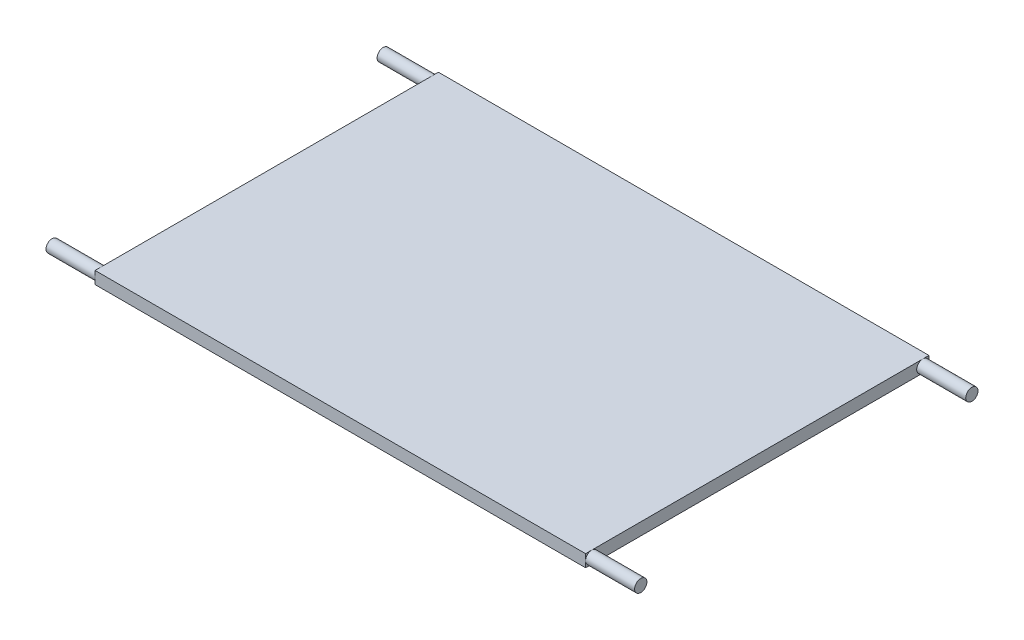
ISO-10303-21;
HEADER;
FILE_DESCRIPTION(('STEP AP214'),'2;1');
FILE_NAME('part.step','',(''),(''),'','','');
FILE_SCHEMA(('AUTOMOTIVE_DESIGN { 1 0 10303 214 1 1 1 1 }'));
ENDSEC;
DATA;
#1=APPLICATION_CONTEXT('core data for automotive mechanical design processes');
#2=APPLICATION_PROTOCOL_DEFINITION('international standard','automotive_design',2000,#1);
#3=PRODUCT_CONTEXT('',#1,'mechanical');
#4=PRODUCT('Part','Part','',(#3));
#5=PRODUCT_RELATED_PRODUCT_CATEGORY('part','',(#4));
#6=PRODUCT_DEFINITION_FORMATION('','',#4);
#7=PRODUCT_DEFINITION_CONTEXT('part definition',#1,'design');
#8=PRODUCT_DEFINITION('design','',#6,#7);
#9=PRODUCT_DEFINITION_SHAPE('','',#8);
#10=(LENGTH_UNIT() NAMED_UNIT(*) SI_UNIT(.MILLI.,.METRE.));
#11=(NAMED_UNIT(*) PLANE_ANGLE_UNIT() SI_UNIT($,.RADIAN.));
#12=(NAMED_UNIT(*) SI_UNIT($,.STERADIAN.) SOLID_ANGLE_UNIT());
#13=UNCERTAINTY_MEASURE_WITH_UNIT(LENGTH_MEASURE(1.E-05),#10,'distance_accuracy_value','');
#14=(GEOMETRIC_REPRESENTATION_CONTEXT(3) GLOBAL_UNCERTAINTY_ASSIGNED_CONTEXT((#13)) GLOBAL_UNIT_ASSIGNED_CONTEXT((#10,
#11,#12)) REPRESENTATION_CONTEXT('',''));
#15=CARTESIAN_POINT('',(0.,0.,0.));
#16=DIRECTION('',(0.,0.,1.));
#17=DIRECTION('',(1.,0.,0.));
#18=AXIS2_PLACEMENT_3D('',#15,#16,#17);
#19=CARTESIAN_POINT('',(100.,5.,70.));
#20=DIRECTION('',(-1.,0.,0.));
#21=DIRECTION('',(0.,0.,1.));
#22=AXIS2_PLACEMENT_3D('',#19,#20,#21);
#23=PLANE('',#22);
#24=CARTESIAN_POINT('',(100.,2.5,-67.5));
#25=DIRECTION('',(1.,0.,0.));
#26=DIRECTION('',(0.,0.,-1.));
#27=AXIS2_PLACEMENT_3D('',#24,#25,#26);
#28=CIRCLE('',#27,2.50000000000001);
#29=CARTESIAN_POINT('',(100.,0.,-67.5));
#30=VERTEX_POINT('',#29);
#31=CARTESIAN_POINT('',(100.,2.5,-70.));
#32=VERTEX_POINT('',#31);
#33=EDGE_CURVE('E132',#30,#32,#28,.T.);
#34=ORIENTED_EDGE('',*,*,#33,.F.);
#35=DIRECTION('',(0.,0.,-1.));
#36=VECTOR('',#35,1.);
#37=CARTESIAN_POINT('',(100.,0.,70.));
#38=LINE('',#37,#36);
#39=CARTESIAN_POINT('',(100.,0.,-70.));
#40=VERTEX_POINT('',#39);
#41=EDGE_CURVE('E120',#30,#40,#38,.T.);
#42=ORIENTED_EDGE('',*,*,#41,.T.);
#43=DIRECTION('',(0.,-1.,0.));
#44=VECTOR('',#43,1.);
#45=CARTESIAN_POINT('',(100.,5.,-70.));
#46=LINE('',#45,#44);
#47=EDGE_CURVE('E133',#32,#40,#46,.T.);
#48=ORIENTED_EDGE('',*,*,#47,.F.);
#49=EDGE_LOOP('',(#34,#42,#48));
#50=FACE_BOUND('',#49,.T.);
#51=ADVANCED_FACE('F33',(#50),#23,.F.);
#52=CARTESIAN_POINT('',(100.,5.,-67.5));
#53=VERTEX_POINT('',#52);
#54=EDGE_CURVE('E51',#32,#53,#28,.T.);
#55=ORIENTED_EDGE('',*,*,#54,.F.);
#56=CARTESIAN_POINT('',(100.,5.,-70.));
#57=VERTEX_POINT('',#56);
#58=EDGE_CURVE('E37',#57,#32,#46,.T.);
#59=ORIENTED_EDGE('',*,*,#58,.F.);
#60=DIRECTION('',(0.,0.,-1.));
#61=VECTOR('',#60,1.);
#62=CARTESIAN_POINT('',(100.,5.,70.));
#63=LINE('',#62,#61);
#64=EDGE_CURVE('E164',#53,#57,#63,.T.);
#65=ORIENTED_EDGE('',*,*,#64,.F.);
#66=EDGE_LOOP('',(#55,#59,#65));
#67=FACE_BOUND('',#66,.T.);
#68=ADVANCED_FACE('F225',(#67),#23,.F.);
#69=CARTESIAN_POINT('',(-100.,5.,70.));
#70=DIRECTION('',(1.,0.,0.));
#71=DIRECTION('',(0.,0.,-1.));
#72=AXIS2_PLACEMENT_3D('',#69,#70,#71);
#73=PLANE('',#72);
#74=CARTESIAN_POINT('',(-100.,2.5,-67.5));
#75=DIRECTION('',(-1.,0.,0.));
#76=DIRECTION('',(0.,0.,1.));
#77=AXIS2_PLACEMENT_3D('',#74,#75,#76);
#78=CIRCLE('',#77,2.50000000000001);
#79=CARTESIAN_POINT('',(-100.,2.5,-70.));
#80=VERTEX_POINT('',#79);
#81=CARTESIAN_POINT('',(-100.,0.,-67.5));
#82=VERTEX_POINT('',#81);
#83=EDGE_CURVE('E147',#80,#82,#78,.T.);
#84=ORIENTED_EDGE('',*,*,#83,.F.);
#85=DIRECTION('',(0.,-1.,0.));
#86=VECTOR('',#85,1.);
#87=CARTESIAN_POINT('',(-100.,5.,-70.));
#88=LINE('',#87,#86);
#89=CARTESIAN_POINT('',(-100.,0.,-70.));
#90=VERTEX_POINT('',#89);
#91=EDGE_CURVE('E188',#80,#90,#88,.T.);
#92=ORIENTED_EDGE('',*,*,#91,.T.);
#93=DIRECTION('',(0.,0.,1.));
#94=VECTOR('',#93,1.);
#95=CARTESIAN_POINT('',(-100.,0.,70.));
#96=LINE('',#95,#94);
#97=EDGE_CURVE('E176',#90,#82,#96,.T.);
#98=ORIENTED_EDGE('',*,*,#97,.T.);
#99=EDGE_LOOP('',(#84,#92,#98));
#100=FACE_BOUND('',#99,.T.);
#101=ADVANCED_FACE('F196',(#100),#73,.F.);
#102=CARTESIAN_POINT('',(-100.,5.,-67.5));
#103=VERTEX_POINT('',#102);
#104=EDGE_CURVE('E148',#82,#103,#78,.T.);
#105=ORIENTED_EDGE('',*,*,#104,.F.);
#106=CARTESIAN_POINT('',(-100.,0.,67.5));
#107=VERTEX_POINT('',#106);
#108=EDGE_CURVE('E180',#82,#107,#96,.T.);
#109=ORIENTED_EDGE('',*,*,#108,.T.);
#110=CARTESIAN_POINT('',(-100.,2.5,67.5));
#111=DIRECTION('',(-1.,0.,0.));
#112=DIRECTION('',(0.,0.,1.));
#113=AXIS2_PLACEMENT_3D('',#110,#111,#112);
#114=CIRCLE('',#113,2.5);
#115=CARTESIAN_POINT('',(-100.,5.,67.5));
#116=VERTEX_POINT('',#115);
#117=EDGE_CURVE('E158',#116,#107,#114,.T.);
#118=ORIENTED_EDGE('',*,*,#117,.F.);
#119=DIRECTION('',(0.,0.,1.));
#120=VECTOR('',#119,1.);
#121=CARTESIAN_POINT('',(-100.,5.,70.));
#122=LINE('',#121,#120);
#123=EDGE_CURVE('E171',#103,#116,#122,.T.);
#124=ORIENTED_EDGE('',*,*,#123,.F.);
#125=EDGE_LOOP('',(#105,#109,#118,#124));
#126=FACE_BOUND('',#125,.T.);
#127=ADVANCED_FACE('F244',(#126),#73,.F.);
#128=CARTESIAN_POINT('',(100.,2.5,67.5));
#129=DIRECTION('',(1.,0.,0.));
#130=DIRECTION('',(0.,0.,-1.));
#131=AXIS2_PLACEMENT_3D('',#128,#129,#130);
#132=CIRCLE('',#131,2.5);
#133=CARTESIAN_POINT('',(100.,5.,67.5));
#134=VERTEX_POINT('',#133);
#135=CARTESIAN_POINT('',(100.,2.5,70.));
#136=VERTEX_POINT('',#135);
#137=EDGE_CURVE('E44',#134,#136,#132,.T.);
#138=ORIENTED_EDGE('',*,*,#137,.F.);
#139=CARTESIAN_POINT('',(100.,5.,70.));
#140=VERTEX_POINT('',#139);
#141=EDGE_CURVE('E160',#140,#134,#63,.T.);
#142=ORIENTED_EDGE('',*,*,#141,.F.);
#143=DIRECTION('',(0.,-1.,0.));
#144=VECTOR('',#143,1.);
#145=CARTESIAN_POINT('',(100.,5.,70.));
#146=LINE('',#145,#144);
#147=EDGE_CURVE('E183',#140,#136,#146,.T.);
#148=ORIENTED_EDGE('',*,*,#147,.T.);
#149=EDGE_LOOP('',(#138,#142,#148));
#150=FACE_BOUND('',#149,.T.);
#151=ADVANCED_FACE('F232',(#150),#23,.F.);
#152=CARTESIAN_POINT('',(100.,0.,67.5));
#153=VERTEX_POINT('',#152);
#154=EDGE_CURVE('E11',#136,#153,#132,.T.);
#155=ORIENTED_EDGE('',*,*,#154,.F.);
#156=CARTESIAN_POINT('',(100.,0.,70.));
#157=VERTEX_POINT('',#156);
#158=EDGE_CURVE('E172',#136,#157,#146,.T.);
#159=ORIENTED_EDGE('',*,*,#158,.T.);
#160=EDGE_CURVE('E119',#157,#153,#38,.T.);
#161=ORIENTED_EDGE('',*,*,#160,.T.);
#162=EDGE_LOOP('',(#155,#159,#161));
#163=FACE_BOUND('',#162,.T.);
#164=ADVANCED_FACE('F236',(#163),#23,.F.);
#165=CARTESIAN_POINT('',(-100.,2.5,70.));
#166=VERTEX_POINT('',#165);
#167=EDGE_CURVE('E151',#166,#116,#114,.T.);
#168=ORIENTED_EDGE('',*,*,#167,.F.);
#169=DIRECTION('',(0.,-1.,0.));
#170=VECTOR('',#169,1.);
#171=CARTESIAN_POINT('',(-100.,5.,70.));
#172=LINE('',#171,#170);
#173=CARTESIAN_POINT('',(-100.,5.,70.));
#174=VERTEX_POINT('',#173);
#175=EDGE_CURVE('E187',#174,#166,#172,.T.);
#176=ORIENTED_EDGE('',*,*,#175,.F.);
#177=EDGE_CURVE('E166',#116,#174,#122,.T.);
#178=ORIENTED_EDGE('',*,*,#177,.F.);
#179=EDGE_LOOP('',(#168,#176,#178));
#180=FACE_BOUND('',#179,.T.);
#181=ADVANCED_FACE('F221',(#180),#73,.F.);
#182=EDGE_CURVE('E144',#103,#80,#78,.T.);
#183=ORIENTED_EDGE('',*,*,#182,.F.);
#184=CARTESIAN_POINT('',(-100.,5.,-70.));
#185=VERTEX_POINT('',#184);
#186=EDGE_CURVE('E167',#185,#103,#122,.T.);
#187=ORIENTED_EDGE('',*,*,#186,.F.);
#188=EDGE_CURVE('E189',#185,#80,#88,.T.);
#189=ORIENTED_EDGE('',*,*,#188,.T.);
#190=EDGE_LOOP('',(#183,#187,#189));
#191=FACE_BOUND('',#190,.T.);
#192=ADVANCED_FACE('F242',(#191),#73,.F.);
#193=EDGE_CURVE('E59',#53,#30,#28,.T.);
#194=ORIENTED_EDGE('',*,*,#193,.F.);
#195=EDGE_CURVE('E163',#134,#53,#63,.T.);
#196=ORIENTED_EDGE('',*,*,#195,.F.);
#197=EDGE_CURVE('E42',#153,#134,#132,.T.);
#198=ORIENTED_EDGE('',*,*,#197,.F.);
#199=EDGE_CURVE('E113',#153,#30,#38,.T.);
#200=ORIENTED_EDGE('',*,*,#199,.T.);
#201=EDGE_LOOP('',(#194,#196,#198,#200));
#202=FACE_BOUND('',#201,.T.);
#203=ADVANCED_FACE('F35',(#202),#23,.F.);
#204=CARTESIAN_POINT('',(-100.,5.,-70.));
#205=DIRECTION('',(0.,0.,1.));
#206=DIRECTION('',(1.,0.,0.));
#207=AXIS2_PLACEMENT_3D('',#204,#205,#206);
#208=PLANE('',#207);
#209=DIRECTION('',(-1.,0.,0.));
#210=VECTOR('',#209,1.);
#211=CARTESIAN_POINT('',(-100.,0.,-70.));
#212=LINE('',#211,#210);
#213=EDGE_CURVE('E128',#40,#90,#212,.T.);
#214=ORIENTED_EDGE('',*,*,#213,.T.);
#215=ORIENTED_EDGE('',*,*,#91,.F.);
#216=ORIENTED_EDGE('',*,*,#188,.F.);
#217=DIRECTION('',(-1.,0.,0.));
#218=VECTOR('',#217,1.);
#219=CARTESIAN_POINT('',(-100.,5.,-70.));
#220=LINE('',#219,#218);
#221=EDGE_CURVE('E162',#57,#185,#220,.T.);
#222=ORIENTED_EDGE('',*,*,#221,.F.);
#223=ORIENTED_EDGE('',*,*,#58,.T.);
#224=ORIENTED_EDGE('',*,*,#47,.T.);
#225=EDGE_LOOP('',(#214,#215,#216,#222,#223,#224));
#226=FACE_BOUND('',#225,.T.);
#227=ADVANCED_FACE('F199',(#226),#208,.F.);
#228=EDGE_CURVE('E159',#107,#166,#114,.T.);
#229=ORIENTED_EDGE('',*,*,#228,.F.);
#230=CARTESIAN_POINT('',(-100.,0.,70.));
#231=VERTEX_POINT('',#230);
#232=EDGE_CURVE('E175',#107,#231,#96,.T.);
#233=ORIENTED_EDGE('',*,*,#232,.T.);
#234=EDGE_CURVE('E186',#166,#231,#172,.T.);
#235=ORIENTED_EDGE('',*,*,#234,.F.);
#236=EDGE_LOOP('',(#229,#233,#235));
#237=FACE_BOUND('',#236,.T.);
#238=ADVANCED_FACE('F210',(#237),#73,.F.);
#239=CARTESIAN_POINT('',(-100.,5.,70.));
#240=DIRECTION('',(0.,0.,-1.));
#241=DIRECTION('',(-1.,0.,0.));
#242=AXIS2_PLACEMENT_3D('',#239,#240,#241);
#243=PLANE('',#242);
#244=DIRECTION('',(1.,0.,0.));
#245=VECTOR('',#244,1.);
#246=CARTESIAN_POINT('',(-100.,0.,70.));
#247=LINE('',#246,#245);
#248=EDGE_CURVE('E179',#231,#157,#247,.T.);
#249=ORIENTED_EDGE('',*,*,#248,.T.);
#250=ORIENTED_EDGE('',*,*,#158,.F.);
#251=ORIENTED_EDGE('',*,*,#147,.F.);
#252=DIRECTION('',(1.,0.,0.));
#253=VECTOR('',#252,1.);
#254=CARTESIAN_POINT('',(-100.,5.,70.));
#255=LINE('',#254,#253);
#256=EDGE_CURVE('E170',#174,#140,#255,.T.);
#257=ORIENTED_EDGE('',*,*,#256,.F.);
#258=ORIENTED_EDGE('',*,*,#175,.T.);
#259=ORIENTED_EDGE('',*,*,#234,.T.);
#260=EDGE_LOOP('',(#249,#250,#251,#257,#258,#259));
#261=FACE_BOUND('',#260,.T.);
#262=ADVANCED_FACE('F215',(#261),#243,.F.);
#263=CARTESIAN_POINT('',(0.,5.,0.));
#264=DIRECTION('',(0.,-1.,0.));
#265=DIRECTION('',(0.,0.,-1.));
#266=AXIS2_PLACEMENT_3D('',#263,#264,#265);
#267=PLANE('',#266);
#268=ORIENTED_EDGE('',*,*,#141,.T.);
#269=ORIENTED_EDGE('',*,*,#195,.T.);
#270=ORIENTED_EDGE('',*,*,#64,.T.);
#271=ORIENTED_EDGE('',*,*,#221,.T.);
#272=ORIENTED_EDGE('',*,*,#186,.T.);
#273=ORIENTED_EDGE('',*,*,#123,.T.);
#274=ORIENTED_EDGE('',*,*,#177,.T.);
#275=ORIENTED_EDGE('',*,*,#256,.T.);
#276=EDGE_LOOP('',(#268,#269,#270,#271,#272,#273,#274,#275));
#277=FACE_BOUND('',#276,.T.);
#278=ADVANCED_FACE('F228',(#277),#267,.F.);
#279=CARTESIAN_POINT('',(0.,0.,0.));
#280=DIRECTION('',(0.,-1.,0.));
#281=DIRECTION('',(0.,0.,-1.));
#282=AXIS2_PLACEMENT_3D('',#279,#280,#281);
#283=PLANE('',#282);
#284=ORIENTED_EDGE('',*,*,#160,.F.);
#285=ORIENTED_EDGE('',*,*,#248,.F.);
#286=ORIENTED_EDGE('',*,*,#232,.F.);
#287=ORIENTED_EDGE('',*,*,#108,.F.);
#288=ORIENTED_EDGE('',*,*,#97,.F.);
#289=ORIENTED_EDGE('',*,*,#213,.F.);
#290=ORIENTED_EDGE('',*,*,#41,.F.);
#291=ORIENTED_EDGE('',*,*,#199,.F.);
#292=EDGE_LOOP('',(#284,#285,#286,#287,#288,#289,#290,#291));
#293=FACE_BOUND('',#292,.T.);
#294=ADVANCED_FACE('F125',(#293),#283,.T.);
#295=CARTESIAN_POINT('',(-120.,2.5,67.5));
#296=DIRECTION('',(1.,0.,0.));
#297=DIRECTION('',(0.,0.,-1.));
#298=AXIS2_PLACEMENT_3D('',#295,#296,#297);
#299=CYLINDRICAL_SURFACE('',#298,2.5);
#300=CARTESIAN_POINT('',(-120.,2.5,67.5));
#301=DIRECTION('',(-1.,0.,0.));
#302=DIRECTION('',(0.,0.,1.));
#303=AXIS2_PLACEMENT_3D('',#300,#301,#302);
#304=CIRCLE('',#303,2.5);
#305=CARTESIAN_POINT('',(-120.,2.5,70.));
#306=VERTEX_POINT('',#305);
#307=EDGE_CURVE('E130',#306,#306,#304,.T.);
#308=ORIENTED_EDGE('',*,*,#307,.F.);
#309=EDGE_LOOP('',(#308));
#310=FACE_BOUND('',#309,.T.);
#311=ORIENTED_EDGE('',*,*,#167,.T.);
#312=ORIENTED_EDGE('',*,*,#117,.T.);
#313=ORIENTED_EDGE('',*,*,#228,.T.);
#314=EDGE_LOOP('',(#311,#312,#313));
#315=FACE_BOUND('',#314,.T.);
#316=ADVANCED_FACE('F223',(#310,#315),#299,.T.);
#317=CARTESIAN_POINT('',(-120.,2.5,67.5));
#318=DIRECTION('',(-1.,0.,0.));
#319=DIRECTION('',(0.,0.,1.));
#320=AXIS2_PLACEMENT_3D('',#317,#318,#319);
#321=PLANE('',#320);
#322=ORIENTED_EDGE('',*,*,#307,.T.);
#323=EDGE_LOOP('',(#322));
#324=FACE_BOUND('',#323,.T.);
#325=ADVANCED_FACE('F294',(#324),#321,.T.);
#326=CARTESIAN_POINT('',(120.,2.5,67.5));
#327=DIRECTION('',(-1.,0.,0.));
#328=DIRECTION('',(0.,0.,1.));
#329=AXIS2_PLACEMENT_3D('',#326,#327,#328);
#330=CYLINDRICAL_SURFACE('',#329,2.5);
#331=CARTESIAN_POINT('',(120.,2.5,67.5));
#332=DIRECTION('',(1.,0.,0.));
#333=DIRECTION('',(0.,0.,-1.));
#334=AXIS2_PLACEMENT_3D('',#331,#332,#333);
#335=CIRCLE('',#334,2.5);
#336=CARTESIAN_POINT('',(120.,2.5,65.));
#337=VERTEX_POINT('',#336);
#338=EDGE_CURVE('E149',#337,#337,#335,.T.);
#339=ORIENTED_EDGE('',*,*,#338,.F.);
#340=EDGE_LOOP('',(#339));
#341=FACE_BOUND('',#340,.T.);
#342=ORIENTED_EDGE('',*,*,#137,.T.);
#343=ORIENTED_EDGE('',*,*,#154,.T.);
#344=ORIENTED_EDGE('',*,*,#197,.T.);
#345=EDGE_LOOP('',(#342,#343,#344));
#346=FACE_BOUND('',#345,.T.);
#347=ADVANCED_FACE('F234',(#341,#346),#330,.T.);
#348=CARTESIAN_POINT('',(120.,2.5,67.5));
#349=DIRECTION('',(1.,0.,0.));
#350=DIRECTION('',(0.,0.,-1.));
#351=AXIS2_PLACEMENT_3D('',#348,#349,#350);
#352=PLANE('',#351);
#353=ORIENTED_EDGE('',*,*,#338,.T.);
#354=EDGE_LOOP('',(#353));
#355=FACE_BOUND('',#354,.T.);
#356=ADVANCED_FACE('F287',(#355),#352,.T.);
#357=CARTESIAN_POINT('',(-120.,2.5,-67.5));
#358=DIRECTION('',(1.,0.,0.));
#359=DIRECTION('',(0.,0.,-1.));
#360=AXIS2_PLACEMENT_3D('',#357,#358,#359);
#361=CYLINDRICAL_SURFACE('',#360,2.50000000000001);
#362=CARTESIAN_POINT('',(-120.,2.5,-67.5));
#363=DIRECTION('',(-1.,0.,0.));
#364=DIRECTION('',(0.,0.,1.));
#365=AXIS2_PLACEMENT_3D('',#362,#363,#364);
#366=CIRCLE('',#365,2.50000000000001);
#367=CARTESIAN_POINT('',(-120.,2.5,-65.));
#368=VERTEX_POINT('',#367);
#369=EDGE_CURVE('E141',#368,#368,#366,.T.);
#370=ORIENTED_EDGE('',*,*,#369,.F.);
#371=EDGE_LOOP('',(#370));
#372=FACE_BOUND('',#371,.T.);
#373=ORIENTED_EDGE('',*,*,#182,.T.);
#374=ORIENTED_EDGE('',*,*,#83,.T.);
#375=ORIENTED_EDGE('',*,*,#104,.T.);
#376=EDGE_LOOP('',(#373,#374,#375));
#377=FACE_BOUND('',#376,.T.);
#378=ADVANCED_FACE('F268',(#372,#377),#361,.T.);
#379=CARTESIAN_POINT('',(-120.,2.5,-67.5));
#380=DIRECTION('',(-1.,0.,0.));
#381=DIRECTION('',(0.,0.,1.));
#382=AXIS2_PLACEMENT_3D('',#379,#380,#381);
#383=PLANE('',#382);
#384=ORIENTED_EDGE('',*,*,#369,.T.);
#385=EDGE_LOOP('',(#384));
#386=FACE_BOUND('',#385,.T.);
#387=ADVANCED_FACE('F275',(#386),#383,.T.);
#388=CARTESIAN_POINT('',(120.,2.5,-67.5));
#389=DIRECTION('',(-1.,0.,0.));
#390=DIRECTION('',(0.,0.,1.));
#391=AXIS2_PLACEMENT_3D('',#388,#389,#390);
#392=CYLINDRICAL_SURFACE('',#391,2.50000000000001);
#393=CARTESIAN_POINT('',(120.,2.5,-67.5));
#394=DIRECTION('',(1.,0.,0.));
#395=DIRECTION('',(0.,0.,-1.));
#396=AXIS2_PLACEMENT_3D('',#393,#394,#395);
#397=CIRCLE('',#396,2.50000000000001);
#398=CARTESIAN_POINT('',(120.,2.5,-70.));
#399=VERTEX_POINT('',#398);
#400=EDGE_CURVE('E138',#399,#399,#397,.T.);
#401=ORIENTED_EDGE('',*,*,#400,.F.);
#402=EDGE_LOOP('',(#401));
#403=FACE_BOUND('',#402,.T.);
#404=ORIENTED_EDGE('',*,*,#54,.T.);
#405=ORIENTED_EDGE('',*,*,#193,.T.);
#406=ORIENTED_EDGE('',*,*,#33,.T.);
#407=EDGE_LOOP('',(#404,#405,#406));
#408=FACE_BOUND('',#407,.T.);
#409=ADVANCED_FACE('F137',(#403,#408),#392,.T.);
#410=CARTESIAN_POINT('',(120.,2.5,-67.5));
#411=DIRECTION('',(1.,0.,0.));
#412=DIRECTION('',(0.,0.,-1.));
#413=AXIS2_PLACEMENT_3D('',#410,#411,#412);
#414=PLANE('',#413);
#415=ORIENTED_EDGE('',*,*,#400,.T.);
#416=EDGE_LOOP('',(#415));
#417=FACE_BOUND('',#416,.T.);
#418=ADVANCED_FACE('F272',(#417),#414,.T.);
#419=CLOSED_SHELL('',(#51,#68,#101,#127,#151,#164,#181,#192,#203,#227,#238,#262,#278,#294,#316,
#325,#347,#356,#378,#387,#409,#418));
#420=MANIFOLD_SOLID_BREP('B2',#419);
#421=ADVANCED_BREP_SHAPE_REPRESENTATION('',(#18,#420),#14);
#422=SHAPE_DEFINITION_REPRESENTATION(#9,#421);
ENDSEC;
END-ISO-10303-21;
